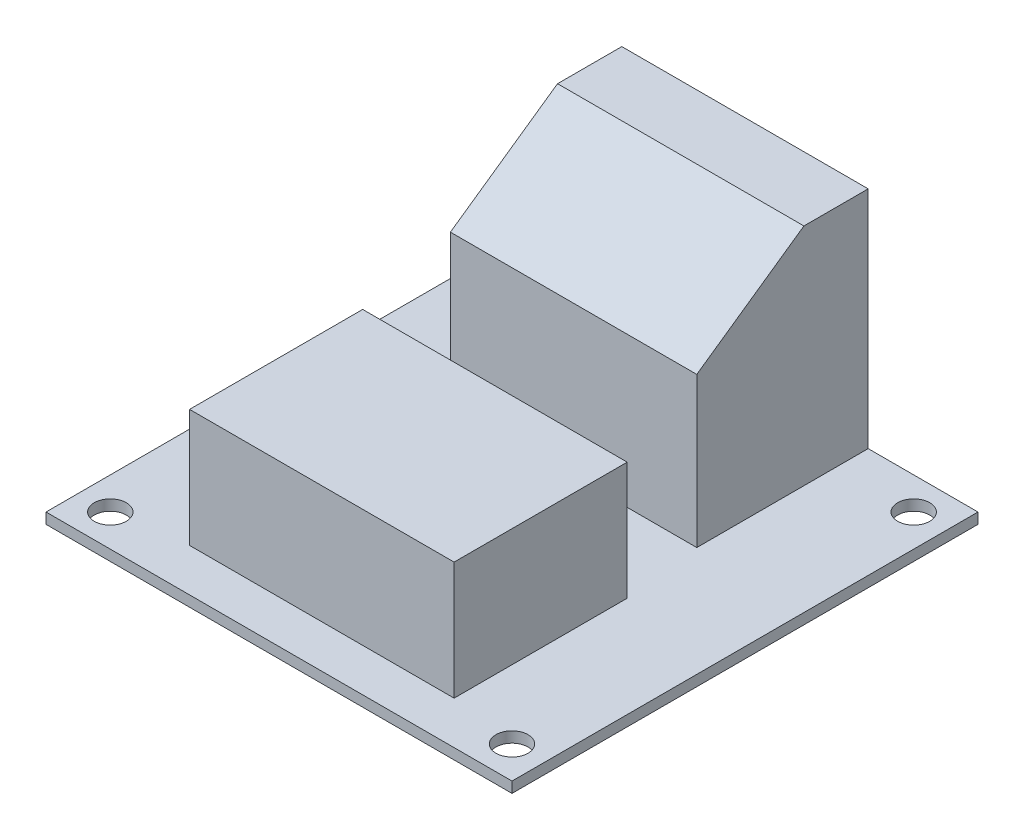
ISO-10303-21;
HEADER;
FILE_DESCRIPTION(('STEP AP214'),'2;1');
FILE_NAME('part.step','',(''),(''),'','','');
FILE_SCHEMA(('AUTOMOTIVE_DESIGN { 1 0 10303 214 1 1 1 1 }'));
ENDSEC;
DATA;
#1=APPLICATION_CONTEXT('core data for automotive mechanical design processes');
#2=APPLICATION_PROTOCOL_DEFINITION('international standard','automotive_design',2000,#1);
#3=PRODUCT_CONTEXT('',#1,'mechanical');
#4=PRODUCT('Part','Part','',(#3));
#5=PRODUCT_RELATED_PRODUCT_CATEGORY('part','',(#4));
#6=PRODUCT_DEFINITION_FORMATION('','',#4);
#7=PRODUCT_DEFINITION_CONTEXT('part definition',#1,'design');
#8=PRODUCT_DEFINITION('design','',#6,#7);
#9=PRODUCT_DEFINITION_SHAPE('','',#8);
#10=(LENGTH_UNIT() NAMED_UNIT(*) SI_UNIT(.MILLI.,.METRE.));
#11=(NAMED_UNIT(*) PLANE_ANGLE_UNIT() SI_UNIT($,.RADIAN.));
#12=(NAMED_UNIT(*) SI_UNIT($,.STERADIAN.) SOLID_ANGLE_UNIT());
#13=UNCERTAINTY_MEASURE_WITH_UNIT(LENGTH_MEASURE(1.E-05),#10,'distance_accuracy_value','');
#14=(GEOMETRIC_REPRESENTATION_CONTEXT(3) GLOBAL_UNCERTAINTY_ASSIGNED_CONTEXT((#13)) GLOBAL_UNIT_ASSIGNED_CONTEXT((#10,
#11,#12)) REPRESENTATION_CONTEXT('',''));
#15=CARTESIAN_POINT('',(0.,0.,0.));
#16=DIRECTION('',(0.,0.,1.));
#17=DIRECTION('',(1.,0.,0.));
#18=AXIS2_PLACEMENT_3D('',#15,#16,#17);
#19=CARTESIAN_POINT('',(0.,1.,0.));
#20=DIRECTION('',(0.,-1.,0.));
#21=DIRECTION('',(0.,0.,-1.));
#22=AXIS2_PLACEMENT_3D('',#19,#20,#21);
#23=PLANE('',#22);
#24=DIRECTION('',(0.,0.,1.));
#25=VECTOR('',#24,1.);
#26=CARTESIAN_POINT('',(-11.5,1.,-5.75));
#27=LINE('',#26,#25);
#28=CARTESIAN_POINT('',(-11.5,1.,-21.75));
#29=VERTEX_POINT('',#28);
#30=CARTESIAN_POINT('',(-11.5,1.,-5.75));
#31=VERTEX_POINT('',#30);
#32=EDGE_CURVE('E164',#29,#31,#27,.T.);
#33=ORIENTED_EDGE('',*,*,#32,.F.);
#34=DIRECTION('',(-1.,0.,0.));
#35=VECTOR('',#34,1.);
#36=CARTESIAN_POINT('',(-21.75,1.,-21.75));
#37=LINE('',#36,#35);
#38=CARTESIAN_POINT('',(-21.75,1.,-21.75));
#39=VERTEX_POINT('',#38);
#40=EDGE_CURVE('E211',#29,#39,#37,.T.);
#41=ORIENTED_EDGE('',*,*,#40,.T.);
#42=DIRECTION('',(0.,0.,1.));
#43=VECTOR('',#42,1.);
#44=CARTESIAN_POINT('',(-21.75,1.,21.75));
#45=LINE('',#44,#43);
#46=CARTESIAN_POINT('',(-21.75,1.,21.75));
#47=VERTEX_POINT('',#46);
#48=EDGE_CURVE('E215',#39,#47,#45,.T.);
#49=ORIENTED_EDGE('',*,*,#48,.T.);
#50=DIRECTION('',(1.,0.,0.));
#51=VECTOR('',#50,1.);
#52=CARTESIAN_POINT('',(-21.75,1.,21.75));
#53=LINE('',#52,#51);
#54=CARTESIAN_POINT('',(21.75,1.,21.75));
#55=VERTEX_POINT('',#54);
#56=EDGE_CURVE('E217',#47,#55,#53,.T.);
#57=ORIENTED_EDGE('',*,*,#56,.T.);
#58=DIRECTION('',(0.,0.,-1.));
#59=VECTOR('',#58,1.);
#60=CARTESIAN_POINT('',(21.75,1.,21.75));
#61=LINE('',#60,#59);
#62=CARTESIAN_POINT('',(21.75,1.,-21.75));
#63=VERTEX_POINT('',#62);
#64=EDGE_CURVE('E208',#55,#63,#61,.T.);
#65=ORIENTED_EDGE('',*,*,#64,.T.);
#66=CARTESIAN_POINT('',(11.5,1.,-21.75));
#67=VERTEX_POINT('',#66);
#68=EDGE_CURVE('E213',#63,#67,#37,.T.);
#69=ORIENTED_EDGE('',*,*,#68,.T.);
#70=DIRECTION('',(0.,0.,-1.));
#71=VECTOR('',#70,1.);
#72=CARTESIAN_POINT('',(11.5,1.,-21.75));
#73=LINE('',#72,#71);
#74=CARTESIAN_POINT('',(11.5,1.,-5.75));
#75=VERTEX_POINT('',#74);
#76=EDGE_CURVE('E155',#75,#67,#73,.T.);
#77=ORIENTED_EDGE('',*,*,#76,.F.);
#78=DIRECTION('',(1.,0.,0.));
#79=VECTOR('',#78,1.);
#80=CARTESIAN_POINT('',(11.5,1.,-5.75));
#81=LINE('',#80,#79);
#82=EDGE_CURVE('E152',#31,#75,#81,.T.);
#83=ORIENTED_EDGE('',*,*,#82,.F.);
#84=EDGE_LOOP('',(#33,#41,#49,#57,#65,#69,#77,#83));
#85=FACE_BOUND('',#84,.T.);
#86=CARTESIAN_POINT('',(-18.75,1.,-18.75));
#87=DIRECTION('',(0.,1.,0.));
#88=DIRECTION('',(0.,0.,1.));
#89=AXIS2_PLACEMENT_3D('',#86,#87,#88);
#90=CIRCLE('',#89,1.5);
#91=CARTESIAN_POINT('',(-18.75,1.,-17.25));
#92=VERTEX_POINT('',#91);
#93=EDGE_CURVE('E202',#92,#92,#90,.T.);
#94=ORIENTED_EDGE('',*,*,#93,.F.);
#95=EDGE_LOOP('',(#94));
#96=FACE_BOUND('',#95,.T.);
#97=CARTESIAN_POINT('',(18.75,1.,-18.75));
#98=DIRECTION('',(0.,1.,0.));
#99=DIRECTION('',(0.,0.,1.));
#100=AXIS2_PLACEMENT_3D('',#97,#98,#99);
#101=CIRCLE('',#100,1.5);
#102=CARTESIAN_POINT('',(18.75,1.,-17.25));
#103=VERTEX_POINT('',#102);
#104=EDGE_CURVE('E196',#103,#103,#101,.T.);
#105=ORIENTED_EDGE('',*,*,#104,.F.);
#106=EDGE_LOOP('',(#105));
#107=FACE_BOUND('',#106,.T.);
#108=CARTESIAN_POINT('',(18.75,1.,18.75));
#109=DIRECTION('',(0.,1.,0.));
#110=DIRECTION('',(0.,0.,1.));
#111=AXIS2_PLACEMENT_3D('',#108,#109,#110);
#112=CIRCLE('',#111,1.5);
#113=CARTESIAN_POINT('',(18.75,1.,20.25));
#114=VERTEX_POINT('',#113);
#115=EDGE_CURVE('E190',#114,#114,#112,.T.);
#116=ORIENTED_EDGE('',*,*,#115,.F.);
#117=EDGE_LOOP('',(#116));
#118=FACE_BOUND('',#117,.T.);
#119=CARTESIAN_POINT('',(-18.75,1.,18.75));
#120=DIRECTION('',(0.,1.,0.));
#121=DIRECTION('',(0.,0.,1.));
#122=AXIS2_PLACEMENT_3D('',#119,#120,#121);
#123=CIRCLE('',#122,1.5);
#124=CARTESIAN_POINT('',(-18.75,1.,20.25));
#125=VERTEX_POINT('',#124);
#126=EDGE_CURVE('E184',#125,#125,#123,.T.);
#127=ORIENTED_EDGE('',*,*,#126,.F.);
#128=EDGE_LOOP('',(#127));
#129=FACE_BOUND('',#128,.T.);
#130=DIRECTION('',(0.,0.,-1.));
#131=VECTOR('',#130,1.);
#132=CARTESIAN_POINT('',(12.3466893076341,1.,17.7513777799163));
#133=LINE('',#132,#131);
#134=CARTESIAN_POINT('',(12.3466893076341,1.,17.7513777799163));
#135=VERTEX_POINT('',#134);
#136=CARTESIAN_POINT('',(12.3466893076341,1.,1.59234214237358));
#137=VERTEX_POINT('',#136);
#138=EDGE_CURVE('E151',#135,#137,#133,.T.);
#139=ORIENTED_EDGE('',*,*,#138,.F.);
#140=DIRECTION('',(1.,0.,0.));
#141=VECTOR('',#140,1.);
#142=CARTESIAN_POINT('',(-12.3466893076341,1.,17.7513777799163));
#143=LINE('',#142,#141);
#144=CARTESIAN_POINT('',(-12.3466893076341,1.,17.7513777799163));
#145=VERTEX_POINT('',#144);
#146=EDGE_CURVE('E148',#145,#135,#143,.T.);
#147=ORIENTED_EDGE('',*,*,#146,.F.);
#148=DIRECTION('',(0.,0.,1.));
#149=VECTOR('',#148,1.);
#150=CARTESIAN_POINT('',(-12.3466893076341,1.,17.7513777799163));
#151=LINE('',#150,#149);
#152=CARTESIAN_POINT('',(-12.3466893076341,1.,1.59234214237358));
#153=VERTEX_POINT('',#152);
#154=EDGE_CURVE('E347',#153,#145,#151,.T.);
#155=ORIENTED_EDGE('',*,*,#154,.F.);
#156=DIRECTION('',(-1.,0.,0.));
#157=VECTOR('',#156,1.);
#158=CARTESIAN_POINT('',(-12.3466893076341,1.,1.59234214237358));
#159=LINE('',#158,#157);
#160=EDGE_CURVE('E341',#137,#153,#159,.T.);
#161=ORIENTED_EDGE('',*,*,#160,.F.);
#162=EDGE_LOOP('',(#139,#147,#155,#161));
#163=FACE_BOUND('',#162,.T.);
#164=ADVANCED_FACE('F34',(#85,#96,#107,#118,#129,#163),#23,.F.);
#165=CARTESIAN_POINT('',(0.,0.,0.));
#166=DIRECTION('',(0.,-1.,0.));
#167=DIRECTION('',(0.,0.,-1.));
#168=AXIS2_PLACEMENT_3D('',#165,#166,#167);
#169=PLANE('',#168);
#170=CARTESIAN_POINT('',(18.75,0.,18.75));
#171=DIRECTION('',(0.,1.,0.));
#172=DIRECTION('',(0.,0.,1.));
#173=AXIS2_PLACEMENT_3D('',#170,#171,#172);
#174=CIRCLE('',#173,1.5);
#175=CARTESIAN_POINT('',(18.75,0.,20.25));
#176=VERTEX_POINT('',#175);
#177=EDGE_CURVE('E187',#176,#176,#174,.T.);
#178=ORIENTED_EDGE('',*,*,#177,.T.);
#179=EDGE_LOOP('',(#178));
#180=FACE_BOUND('',#179,.T.);
#181=CARTESIAN_POINT('',(-18.75,0.,-18.75));
#182=DIRECTION('',(0.,1.,0.));
#183=DIRECTION('',(0.,0.,1.));
#184=AXIS2_PLACEMENT_3D('',#181,#182,#183);
#185=CIRCLE('',#184,1.5);
#186=CARTESIAN_POINT('',(-18.75,0.,-17.25));
#187=VERTEX_POINT('',#186);
#188=EDGE_CURVE('E199',#187,#187,#185,.T.);
#189=ORIENTED_EDGE('',*,*,#188,.T.);
#190=EDGE_LOOP('',(#189));
#191=FACE_BOUND('',#190,.T.);
#192=DIRECTION('',(0.,0.,-1.));
#193=VECTOR('',#192,1.);
#194=CARTESIAN_POINT('',(21.75,0.,21.75));
#195=LINE('',#194,#193);
#196=CARTESIAN_POINT('',(21.75,0.,21.75));
#197=VERTEX_POINT('',#196);
#198=CARTESIAN_POINT('',(21.75,0.,-21.75));
#199=VERTEX_POINT('',#198);
#200=EDGE_CURVE('E205',#197,#199,#195,.T.);
#201=ORIENTED_EDGE('',*,*,#200,.F.);
#202=DIRECTION('',(1.,0.,0.));
#203=VECTOR('',#202,1.);
#204=CARTESIAN_POINT('',(-21.75,0.,21.75));
#205=LINE('',#204,#203);
#206=CARTESIAN_POINT('',(-21.75,0.,21.75));
#207=VERTEX_POINT('',#206);
#208=EDGE_CURVE('E212',#207,#197,#205,.T.);
#209=ORIENTED_EDGE('',*,*,#208,.F.);
#210=DIRECTION('',(0.,0.,1.));
#211=VECTOR('',#210,1.);
#212=CARTESIAN_POINT('',(-21.75,0.,21.75));
#213=LINE('',#212,#211);
#214=CARTESIAN_POINT('',(-21.75,0.,-21.75));
#215=VERTEX_POINT('',#214);
#216=EDGE_CURVE('E224',#215,#207,#213,.T.);
#217=ORIENTED_EDGE('',*,*,#216,.F.);
#218=DIRECTION('',(-1.,0.,0.));
#219=VECTOR('',#218,1.);
#220=CARTESIAN_POINT('',(-21.75,0.,-21.75));
#221=LINE('',#220,#219);
#222=EDGE_CURVE('E222',#199,#215,#221,.T.);
#223=ORIENTED_EDGE('',*,*,#222,.F.);
#224=EDGE_LOOP('',(#201,#209,#217,#223));
#225=FACE_BOUND('',#224,.T.);
#226=CARTESIAN_POINT('',(18.75,0.,-18.75));
#227=DIRECTION('',(0.,1.,0.));
#228=DIRECTION('',(0.,0.,1.));
#229=AXIS2_PLACEMENT_3D('',#226,#227,#228);
#230=CIRCLE('',#229,1.5);
#231=CARTESIAN_POINT('',(18.75,0.,-17.25));
#232=VERTEX_POINT('',#231);
#233=EDGE_CURVE('E193',#232,#232,#230,.T.);
#234=ORIENTED_EDGE('',*,*,#233,.T.);
#235=EDGE_LOOP('',(#234));
#236=FACE_BOUND('',#235,.T.);
#237=CARTESIAN_POINT('',(-18.75,0.,18.75));
#238=DIRECTION('',(0.,1.,0.));
#239=DIRECTION('',(0.,0.,1.));
#240=AXIS2_PLACEMENT_3D('',#237,#238,#239);
#241=CIRCLE('',#240,1.5);
#242=CARTESIAN_POINT('',(-18.75,0.,20.25));
#243=VERTEX_POINT('',#242);
#244=EDGE_CURVE('E183',#243,#243,#241,.T.);
#245=ORIENTED_EDGE('',*,*,#244,.T.);
#246=EDGE_LOOP('',(#245));
#247=FACE_BOUND('',#246,.T.);
#248=ADVANCED_FACE('F265',(#180,#191,#225,#236,#247),#169,.T.);
#249=CARTESIAN_POINT('',(21.75,1.,21.75));
#250=DIRECTION('',(-1.,0.,0.));
#251=DIRECTION('',(0.,0.,1.));
#252=AXIS2_PLACEMENT_3D('',#249,#250,#251);
#253=PLANE('',#252);
#254=ORIENTED_EDGE('',*,*,#200,.T.);
#255=DIRECTION('',(0.,-1.,0.));
#256=VECTOR('',#255,1.);
#257=CARTESIAN_POINT('',(21.75,1.,-21.75));
#258=LINE('',#257,#256);
#259=EDGE_CURVE('E235',#63,#199,#258,.T.);
#260=ORIENTED_EDGE('',*,*,#259,.F.);
#261=ORIENTED_EDGE('',*,*,#64,.F.);
#262=DIRECTION('',(0.,-1.,0.));
#263=VECTOR('',#262,1.);
#264=CARTESIAN_POINT('',(21.75,1.,21.75));
#265=LINE('',#264,#263);
#266=EDGE_CURVE('E219',#55,#197,#265,.T.);
#267=ORIENTED_EDGE('',*,*,#266,.T.);
#268=EDGE_LOOP('',(#254,#260,#261,#267));
#269=FACE_BOUND('',#268,.T.);
#270=ADVANCED_FACE('F271',(#269),#253,.F.);
#271=CARTESIAN_POINT('',(-21.75,1.,-21.75));
#272=DIRECTION('',(0.,0.,1.));
#273=DIRECTION('',(1.,0.,0.));
#274=AXIS2_PLACEMENT_3D('',#271,#272,#273);
#275=PLANE('',#274);
#276=ORIENTED_EDGE('',*,*,#222,.T.);
#277=DIRECTION('',(0.,-1.,0.));
#278=VECTOR('',#277,1.);
#279=CARTESIAN_POINT('',(-21.75,1.,-21.75));
#280=LINE('',#279,#278);
#281=EDGE_CURVE('E232',#39,#215,#280,.T.);
#282=ORIENTED_EDGE('',*,*,#281,.F.);
#283=ORIENTED_EDGE('',*,*,#40,.F.);
#284=DIRECTION('',(0.,-1.,0.));
#285=VECTOR('',#284,1.);
#286=CARTESIAN_POINT('',(-11.5,22.,-21.75));
#287=LINE('',#286,#285);
#288=CARTESIAN_POINT('',(-11.5,22.,-21.75));
#289=VERTEX_POINT('',#288);
#290=EDGE_CURVE('E175',#289,#29,#287,.T.);
#291=ORIENTED_EDGE('',*,*,#290,.F.);
#292=DIRECTION('',(-1.,0.,0.));
#293=VECTOR('',#292,1.);
#294=CARTESIAN_POINT('',(-11.5,22.,-21.75));
#295=LINE('',#294,#293);
#296=CARTESIAN_POINT('',(11.5,22.,-21.75));
#297=VERTEX_POINT('',#296);
#298=EDGE_CURVE('E163',#297,#289,#295,.T.);
#299=ORIENTED_EDGE('',*,*,#298,.F.);
#300=DIRECTION('',(0.,-1.,0.));
#301=VECTOR('',#300,1.);
#302=CARTESIAN_POINT('',(11.5,22.,-21.75));
#303=LINE('',#302,#301);
#304=EDGE_CURVE('E178',#297,#67,#303,.T.);
#305=ORIENTED_EDGE('',*,*,#304,.T.);
#306=ORIENTED_EDGE('',*,*,#68,.F.);
#307=ORIENTED_EDGE('',*,*,#259,.T.);
#308=EDGE_LOOP('',(#276,#282,#283,#291,#299,#305,#306,#307));
#309=FACE_BOUND('',#308,.T.);
#310=ADVANCED_FACE('F253',(#309),#275,.F.);
#311=CARTESIAN_POINT('',(-21.75,1.,21.75));
#312=DIRECTION('',(1.,0.,0.));
#313=DIRECTION('',(0.,0.,-1.));
#314=AXIS2_PLACEMENT_3D('',#311,#312,#313);
#315=PLANE('',#314);
#316=ORIENTED_EDGE('',*,*,#216,.T.);
#317=DIRECTION('',(0.,-1.,0.));
#318=VECTOR('',#317,1.);
#319=CARTESIAN_POINT('',(-21.75,1.,21.75));
#320=LINE('',#319,#318);
#321=EDGE_CURVE('E229',#47,#207,#320,.T.);
#322=ORIENTED_EDGE('',*,*,#321,.F.);
#323=ORIENTED_EDGE('',*,*,#48,.F.);
#324=ORIENTED_EDGE('',*,*,#281,.T.);
#325=EDGE_LOOP('',(#316,#322,#323,#324));
#326=FACE_BOUND('',#325,.T.);
#327=ADVANCED_FACE('F282',(#326),#315,.F.);
#328=CARTESIAN_POINT('',(-21.75,1.,21.75));
#329=DIRECTION('',(0.,0.,-1.));
#330=DIRECTION('',(-1.,0.,0.));
#331=AXIS2_PLACEMENT_3D('',#328,#329,#330);
#332=PLANE('',#331);
#333=ORIENTED_EDGE('',*,*,#208,.T.);
#334=ORIENTED_EDGE('',*,*,#266,.F.);
#335=ORIENTED_EDGE('',*,*,#56,.F.);
#336=ORIENTED_EDGE('',*,*,#321,.T.);
#337=EDGE_LOOP('',(#333,#334,#335,#336));
#338=FACE_BOUND('',#337,.T.);
#339=ADVANCED_FACE('F279',(#338),#332,.F.);
#340=CARTESIAN_POINT('',(-18.75,1.,-18.75));
#341=DIRECTION('',(0.,-1.,0.));
#342=DIRECTION('',(0.,0.,-1.));
#343=AXIS2_PLACEMENT_3D('',#340,#341,#342);
#344=CYLINDRICAL_SURFACE('',#343,1.5);
#345=ORIENTED_EDGE('',*,*,#93,.T.);
#346=EDGE_LOOP('',(#345));
#347=FACE_BOUND('',#346,.T.);
#348=ORIENTED_EDGE('',*,*,#188,.F.);
#349=EDGE_LOOP('',(#348));
#350=FACE_BOUND('',#349,.T.);
#351=ADVANCED_FACE('F276',(#347,#350),#344,.F.);
#352=CARTESIAN_POINT('',(18.75,1.,-18.75));
#353=DIRECTION('',(0.,-1.,0.));
#354=DIRECTION('',(0.,0.,-1.));
#355=AXIS2_PLACEMENT_3D('',#352,#353,#354);
#356=CYLINDRICAL_SURFACE('',#355,1.5);
#357=ORIENTED_EDGE('',*,*,#104,.T.);
#358=EDGE_LOOP('',(#357));
#359=FACE_BOUND('',#358,.T.);
#360=ORIENTED_EDGE('',*,*,#233,.F.);
#361=EDGE_LOOP('',(#360));
#362=FACE_BOUND('',#361,.T.);
#363=ADVANCED_FACE('F319',(#359,#362),#356,.F.);
#364=CARTESIAN_POINT('',(18.75,1.,18.75));
#365=DIRECTION('',(0.,-1.,0.));
#366=DIRECTION('',(0.,0.,-1.));
#367=AXIS2_PLACEMENT_3D('',#364,#365,#366);
#368=CYLINDRICAL_SURFACE('',#367,1.5);
#369=ORIENTED_EDGE('',*,*,#115,.T.);
#370=EDGE_LOOP('',(#369));
#371=FACE_BOUND('',#370,.T.);
#372=ORIENTED_EDGE('',*,*,#177,.F.);
#373=EDGE_LOOP('',(#372));
#374=FACE_BOUND('',#373,.T.);
#375=ADVANCED_FACE('F313',(#371,#374),#368,.F.);
#376=CARTESIAN_POINT('',(-18.75,1.,18.75));
#377=DIRECTION('',(0.,-1.,0.));
#378=DIRECTION('',(0.,0.,-1.));
#379=AXIS2_PLACEMENT_3D('',#376,#377,#378);
#380=CYLINDRICAL_SURFACE('',#379,1.5);
#381=ORIENTED_EDGE('',*,*,#126,.T.);
#382=EDGE_LOOP('',(#381));
#383=FACE_BOUND('',#382,.T.);
#384=ORIENTED_EDGE('',*,*,#244,.F.);
#385=EDGE_LOOP('',(#384));
#386=FACE_BOUND('',#385,.T.);
#387=ADVANCED_FACE('F306',(#383,#386),#380,.F.);
#388=CARTESIAN_POINT('',(11.5,22.,-5.75));
#389=DIRECTION('',(0.,0.,-1.));
#390=DIRECTION('',(-1.,0.,0.));
#391=AXIS2_PLACEMENT_3D('',#388,#389,#390);
#392=PLANE('',#391);
#393=DIRECTION('',(0.,-1.,0.));
#394=VECTOR('',#393,1.);
#395=CARTESIAN_POINT('',(11.5,22.,-5.75));
#396=LINE('',#395,#394);
#397=CARTESIAN_POINT('',(11.5,15.,-5.75));
#398=VERTEX_POINT('',#397);
#399=EDGE_CURVE('E181',#398,#75,#396,.T.);
#400=ORIENTED_EDGE('',*,*,#399,.F.);
#401=DIRECTION('',(-1.,0.,0.));
#402=VECTOR('',#401,1.);
#403=CARTESIAN_POINT('',(11.5,15.,-5.75));
#404=LINE('',#403,#402);
#405=CARTESIAN_POINT('',(-11.5,15.,-5.75));
#406=VERTEX_POINT('',#405);
#407=EDGE_CURVE('E42',#398,#406,#404,.T.);
#408=ORIENTED_EDGE('',*,*,#407,.T.);
#409=DIRECTION('',(0.,-1.,0.));
#410=VECTOR('',#409,1.);
#411=CARTESIAN_POINT('',(-11.5,22.,-5.75));
#412=LINE('',#411,#410);
#413=EDGE_CURVE('E168',#406,#31,#412,.T.);
#414=ORIENTED_EDGE('',*,*,#413,.T.);
#415=ORIENTED_EDGE('',*,*,#82,.T.);
#416=EDGE_LOOP('',(#400,#408,#414,#415));
#417=FACE_BOUND('',#416,.T.);
#418=ADVANCED_FACE('F304',(#417),#392,.F.);
#419=CARTESIAN_POINT('',(11.5,22.,-21.75));
#420=DIRECTION('',(-1.,0.,0.));
#421=DIRECTION('',(0.,0.,1.));
#422=AXIS2_PLACEMENT_3D('',#419,#420,#421);
#423=PLANE('',#422);
#424=DIRECTION('',(0.,0.,-1.));
#425=VECTOR('',#424,1.);
#426=CARTESIAN_POINT('',(11.5,22.,-21.75));
#427=LINE('',#426,#425);
#428=CARTESIAN_POINT('',(11.5,22.,-15.7500000000001));
#429=VERTEX_POINT('',#428);
#430=EDGE_CURVE('E161',#429,#297,#427,.T.);
#431=ORIENTED_EDGE('',*,*,#430,.F.);
#432=DIRECTION('',(0.,0.573462344363327,-0.819231920519041));
#433=VECTOR('',#432,1.);
#434=CARTESIAN_POINT('',(11.5,22.,-15.7500000000001));
#435=LINE('',#434,#433);
#436=EDGE_CURVE('E56',#429,#398,#435,.F.);
#437=ORIENTED_EDGE('',*,*,#436,.T.);
#438=ORIENTED_EDGE('',*,*,#399,.T.);
#439=ORIENTED_EDGE('',*,*,#76,.T.);
#440=ORIENTED_EDGE('',*,*,#304,.F.);
#441=EDGE_LOOP('',(#431,#437,#438,#439,#440));
#442=FACE_BOUND('',#441,.T.);
#443=ADVANCED_FACE('F248',(#442),#423,.F.);
#444=CARTESIAN_POINT('',(-11.5,22.,-5.75));
#445=DIRECTION('',(1.,0.,0.));
#446=DIRECTION('',(0.,0.,-1.));
#447=AXIS2_PLACEMENT_3D('',#444,#445,#446);
#448=PLANE('',#447);
#449=ORIENTED_EDGE('',*,*,#413,.F.);
#450=DIRECTION('',(0.,-0.573462344363327,0.819231920519041));
#451=VECTOR('',#450,1.);
#452=CARTESIAN_POINT('',(-11.5,22.,-15.7500000000001));
#453=LINE('',#452,#451);
#454=CARTESIAN_POINT('',(-11.5,22.,-15.7500000000001));
#455=VERTEX_POINT('',#454);
#456=EDGE_CURVE('E11',#406,#455,#453,.F.);
#457=ORIENTED_EDGE('',*,*,#456,.T.);
#458=DIRECTION('',(0.,0.,1.));
#459=VECTOR('',#458,1.);
#460=CARTESIAN_POINT('',(-11.5,22.,-5.75));
#461=LINE('',#460,#459);
#462=EDGE_CURVE('E166',#289,#455,#461,.T.);
#463=ORIENTED_EDGE('',*,*,#462,.F.);
#464=ORIENTED_EDGE('',*,*,#290,.T.);
#465=ORIENTED_EDGE('',*,*,#32,.T.);
#466=EDGE_LOOP('',(#449,#457,#463,#464,#465));
#467=FACE_BOUND('',#466,.T.);
#468=ADVANCED_FACE('F257',(#467),#448,.F.);
#469=CARTESIAN_POINT('',(0.,22.,0.));
#470=DIRECTION('',(0.,-1.,0.));
#471=DIRECTION('',(0.,0.,-1.));
#472=AXIS2_PLACEMENT_3D('',#469,#470,#471);
#473=PLANE('',#472);
#474=ORIENTED_EDGE('',*,*,#462,.T.);
#475=DIRECTION('',(1.,0.,0.));
#476=VECTOR('',#475,1.);
#477=CARTESIAN_POINT('',(0.,22.,-15.7500000000001));
#478=LINE('',#477,#476);
#479=EDGE_CURVE('E238',#455,#429,#478,.T.);
#480=ORIENTED_EDGE('',*,*,#479,.T.);
#481=ORIENTED_EDGE('',*,*,#430,.T.);
#482=ORIENTED_EDGE('',*,*,#298,.T.);
#483=EDGE_LOOP('',(#474,#480,#481,#482));
#484=FACE_BOUND('',#483,.T.);
#485=ADVANCED_FACE('F243',(#484),#473,.F.);
#486=CARTESIAN_POINT('',(12.3466893076341,12.,17.7513777799163));
#487=DIRECTION('',(-1.,0.,0.));
#488=DIRECTION('',(0.,0.,1.));
#489=AXIS2_PLACEMENT_3D('',#486,#487,#488);
#490=PLANE('',#489);
#491=ORIENTED_EDGE('',*,*,#138,.T.);
#492=DIRECTION('',(0.,-1.,0.));
#493=VECTOR('',#492,1.);
#494=CARTESIAN_POINT('',(12.3466893076341,12.,1.59234214237358));
#495=LINE('',#494,#493);
#496=CARTESIAN_POINT('',(12.3466893076341,12.,1.59234214237358));
#497=VERTEX_POINT('',#496);
#498=EDGE_CURVE('E132',#497,#137,#495,.T.);
#499=ORIENTED_EDGE('',*,*,#498,.F.);
#500=DIRECTION('',(0.,0.,-1.));
#501=VECTOR('',#500,1.);
#502=CARTESIAN_POINT('',(12.3466893076341,12.,17.7513777799163));
#503=LINE('',#502,#501);
#504=CARTESIAN_POINT('',(12.3466893076341,12.,17.7513777799163));
#505=VERTEX_POINT('',#504);
#506=EDGE_CURVE('E139',#505,#497,#503,.T.);
#507=ORIENTED_EDGE('',*,*,#506,.F.);
#508=DIRECTION('',(0.,-1.,0.));
#509=VECTOR('',#508,1.);
#510=CARTESIAN_POINT('',(12.3466893076341,12.,17.7513777799163));
#511=LINE('',#510,#509);
#512=EDGE_CURVE('E345',#505,#135,#511,.T.);
#513=ORIENTED_EDGE('',*,*,#512,.T.);
#514=EDGE_LOOP('',(#491,#499,#507,#513));
#515=FACE_BOUND('',#514,.T.);
#516=ADVANCED_FACE('F150',(#515),#490,.F.);
#517=CARTESIAN_POINT('',(-12.3466893076341,12.,1.59234214237358));
#518=DIRECTION('',(0.,0.,1.));
#519=DIRECTION('',(1.,0.,0.));
#520=AXIS2_PLACEMENT_3D('',#517,#518,#519);
#521=PLANE('',#520);
#522=ORIENTED_EDGE('',*,*,#160,.T.);
#523=DIRECTION('',(0.,-1.,0.));
#524=VECTOR('',#523,1.);
#525=CARTESIAN_POINT('',(-12.3466893076341,12.,1.59234214237358));
#526=LINE('',#525,#524);
#527=CARTESIAN_POINT('',(-12.3466893076341,12.,1.59234214237358));
#528=VERTEX_POINT('',#527);
#529=EDGE_CURVE('E135',#528,#153,#526,.T.);
#530=ORIENTED_EDGE('',*,*,#529,.F.);
#531=DIRECTION('',(-1.,0.,0.));
#532=VECTOR('',#531,1.);
#533=CARTESIAN_POINT('',(-12.3466893076341,12.,1.59234214237358));
#534=LINE('',#533,#532);
#535=EDGE_CURVE('E127',#497,#528,#534,.T.);
#536=ORIENTED_EDGE('',*,*,#535,.F.);
#537=ORIENTED_EDGE('',*,*,#498,.T.);
#538=EDGE_LOOP('',(#522,#530,#536,#537));
#539=FACE_BOUND('',#538,.T.);
#540=ADVANCED_FACE('F130',(#539),#521,.F.);
#541=CARTESIAN_POINT('',(-12.3466893076341,12.,17.7513777799163));
#542=DIRECTION('',(1.,0.,0.));
#543=DIRECTION('',(0.,0.,-1.));
#544=AXIS2_PLACEMENT_3D('',#541,#542,#543);
#545=PLANE('',#544);
#546=ORIENTED_EDGE('',*,*,#154,.T.);
#547=DIRECTION('',(0.,-1.,0.));
#548=VECTOR('',#547,1.);
#549=CARTESIAN_POINT('',(-12.3466893076341,12.,17.7513777799163));
#550=LINE('',#549,#548);
#551=CARTESIAN_POINT('',(-12.3466893076341,12.,17.7513777799163));
#552=VERTEX_POINT('',#551);
#553=EDGE_CURVE('E157',#552,#145,#550,.T.);
#554=ORIENTED_EDGE('',*,*,#553,.F.);
#555=DIRECTION('',(0.,0.,1.));
#556=VECTOR('',#555,1.);
#557=CARTESIAN_POINT('',(-12.3466893076341,12.,17.7513777799163));
#558=LINE('',#557,#556);
#559=EDGE_CURVE('E138',#528,#552,#558,.T.);
#560=ORIENTED_EDGE('',*,*,#559,.F.);
#561=ORIENTED_EDGE('',*,*,#529,.T.);
#562=EDGE_LOOP('',(#546,#554,#560,#561));
#563=FACE_BOUND('',#562,.T.);
#564=ADVANCED_FACE('F355',(#563),#545,.F.);
#565=CARTESIAN_POINT('',(-12.3466893076341,12.,17.7513777799163));
#566=DIRECTION('',(0.,0.,-1.));
#567=DIRECTION('',(-1.,0.,0.));
#568=AXIS2_PLACEMENT_3D('',#565,#566,#567);
#569=PLANE('',#568);
#570=ORIENTED_EDGE('',*,*,#146,.T.);
#571=ORIENTED_EDGE('',*,*,#512,.F.);
#572=DIRECTION('',(1.,0.,0.));
#573=VECTOR('',#572,1.);
#574=CARTESIAN_POINT('',(-12.3466893076341,12.,17.7513777799163));
#575=LINE('',#574,#573);
#576=EDGE_CURVE('E144',#552,#505,#575,.T.);
#577=ORIENTED_EDGE('',*,*,#576,.F.);
#578=ORIENTED_EDGE('',*,*,#553,.T.);
#579=EDGE_LOOP('',(#570,#571,#577,#578));
#580=FACE_BOUND('',#579,.T.);
#581=ADVANCED_FACE('F262',(#580),#569,.F.);
#582=CARTESIAN_POINT('',(0.,12.,0.));
#583=DIRECTION('',(0.,-1.,0.));
#584=DIRECTION('',(0.,0.,-1.));
#585=AXIS2_PLACEMENT_3D('',#582,#583,#584);
#586=PLANE('',#585);
#587=ORIENTED_EDGE('',*,*,#506,.T.);
#588=ORIENTED_EDGE('',*,*,#535,.T.);
#589=ORIENTED_EDGE('',*,*,#559,.T.);
#590=ORIENTED_EDGE('',*,*,#576,.T.);
#591=EDGE_LOOP('',(#587,#588,#589,#590));
#592=FACE_BOUND('',#591,.T.);
#593=ADVANCED_FACE('F142',(#592),#586,.F.);
#594=CARTESIAN_POINT('',(0.,22.,-15.7500000000001));
#595=DIRECTION('',(0.,-0.819231920519041,-0.573462344363327));
#596=DIRECTION('',(1.,0.,0.));
#597=AXIS2_PLACEMENT_3D('',#594,#595,#596);
#598=PLANE('',#597);
#599=ORIENTED_EDGE('',*,*,#456,.F.);
#600=ORIENTED_EDGE('',*,*,#407,.F.);
#601=ORIENTED_EDGE('',*,*,#436,.F.);
#602=ORIENTED_EDGE('',*,*,#479,.F.);
#603=EDGE_LOOP('',(#599,#600,#601,#602));
#604=FACE_BOUND('',#603,.T.);
#605=ADVANCED_FACE('F36',(#604),#598,.F.);
#606=CLOSED_SHELL('',(#164,#248,#270,#310,#327,#339,#351,#363,#375,#387,#418,#443,#468,#485,
#516,#540,#564,#581,#593,#605));
#607=MANIFOLD_SOLID_BREP('B2',#606);
#608=ADVANCED_BREP_SHAPE_REPRESENTATION('',(#18,#607),#14);
#609=SHAPE_DEFINITION_REPRESENTATION(#9,#608);
ENDSEC;
END-ISO-10303-21;
